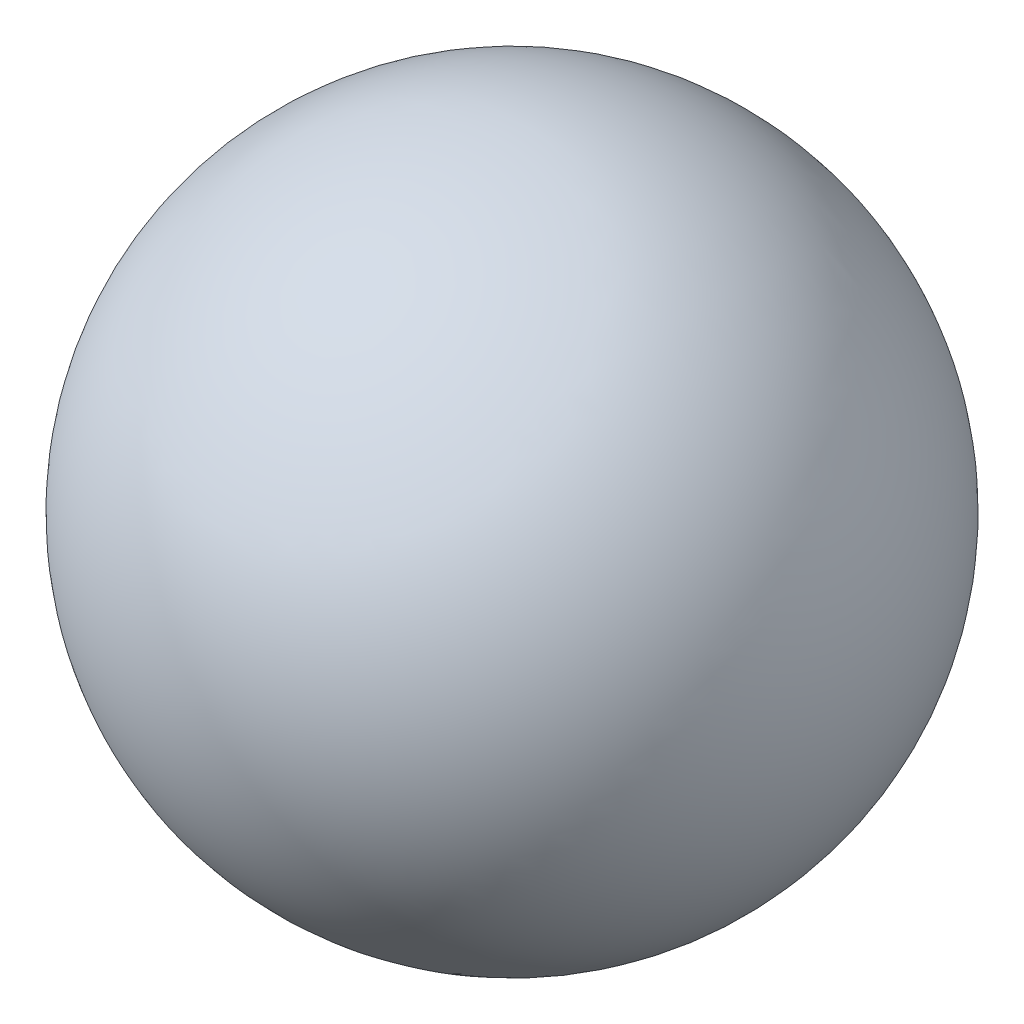
ISO-10303-21;
HEADER;
FILE_DESCRIPTION(('STEP AP214'),'2;1');
FILE_NAME('part.step','',(''),(''),'','','');
FILE_SCHEMA(('AUTOMOTIVE_DESIGN { 1 0 10303 214 1 1 1 1 }'));
ENDSEC;
DATA;
#1=APPLICATION_CONTEXT('core data for automotive mechanical design processes');
#2=APPLICATION_PROTOCOL_DEFINITION('international standard','automotive_design',2000,#1);
#3=PRODUCT_CONTEXT('',#1,'mechanical');
#4=PRODUCT('Part','Part','',(#3));
#5=PRODUCT_RELATED_PRODUCT_CATEGORY('part','',(#4));
#6=PRODUCT_DEFINITION_FORMATION('','',#4);
#7=PRODUCT_DEFINITION_CONTEXT('part definition',#1,'design');
#8=PRODUCT_DEFINITION('design','',#6,#7);
#9=PRODUCT_DEFINITION_SHAPE('','',#8);
#10=(LENGTH_UNIT() NAMED_UNIT(*) SI_UNIT(.MILLI.,.METRE.));
#11=(NAMED_UNIT(*) PLANE_ANGLE_UNIT() SI_UNIT($,.RADIAN.));
#12=(NAMED_UNIT(*) SI_UNIT($,.STERADIAN.) SOLID_ANGLE_UNIT());
#13=UNCERTAINTY_MEASURE_WITH_UNIT(LENGTH_MEASURE(1.E-05),#10,'distance_accuracy_value','');
#14=(GEOMETRIC_REPRESENTATION_CONTEXT(3) GLOBAL_UNCERTAINTY_ASSIGNED_CONTEXT((#13)) GLOBAL_UNIT_ASSIGNED_CONTEXT((#10,
#11,#12)) REPRESENTATION_CONTEXT('',''));
#15=CARTESIAN_POINT('',(0.,0.,0.));
#16=DIRECTION('',(0.,0.,1.));
#17=DIRECTION('',(1.,0.,0.));
#18=AXIS2_PLACEMENT_3D('',#15,#16,#17);
#19=CARTESIAN_POINT('',(0.,0.,0.));
#20=DIRECTION('',(0.,0.,-1.));
#21=DIRECTION('',(-1.,0.,0.));
#22=AXIS2_PLACEMENT_3D('',#19,#20,#21);
#23=SPHERICAL_SURFACE('',#22,20.);
#24=CARTESIAN_POINT('',(-6.5,0.,0.));
#25=DIRECTION('',(1.,0.,0.));
#26=DIRECTION('',(0.,0.,-1.));
#27=AXIS2_PLACEMENT_3D('',#24,#25,#26);
#28=CIRCLE('',#27,18.9142803193777);
#29=CARTESIAN_POINT('',(-6.5,-16.8967452487158,8.5));
#30=VERTEX_POINT('',#29);
#31=CARTESIAN_POINT('',(-6.5,-16.8967452487158,-8.5));
#32=VERTEX_POINT('',#31);
#33=EDGE_CURVE('E136',#30,#32,#28,.T.);
#34=ORIENTED_EDGE('',*,*,#33,.F.);
#35=CARTESIAN_POINT('',(-2.5,-15.4110350074224,12.5));
#36=CARTESIAN_POINT('',(-2.59738038519083,-15.3952282696164,12.5000148213943));
#37=CARTESIAN_POINT('',(-2.69508024486914,-15.3813255532214,12.4964443244474));
#38=CARTESIAN_POINT('',(-2.89044586607563,-15.3574814182854,12.4820993500437));
#39=CARTESIAN_POINT('',(-2.98811162156256,-15.3475405121033,12.4713239412978));
#40=CARTESIAN_POINT('',(-3.18255066929817,-15.3317903628193,12.4425594165742));
#41=CARTESIAN_POINT('',(-3.27932516375751,-15.325974361548,12.4245821759372));
#42=CARTESIAN_POINT('',(-3.47142933766073,-15.318532360721,12.3814961401043));
#43=CARTESIAN_POINT('',(-3.56675913489966,-15.3169060177094,12.3563879296716));
#44=CARTESIAN_POINT('',(-3.75539293433253,-15.3178685885579,12.2991727800464));
#45=CARTESIAN_POINT('',(-3.84869448864158,-15.3204623373541,12.2670578498045));
#46=CARTESIAN_POINT('',(-4.03251988927804,-15.3298356353688,12.1960918680488));
#47=CARTESIAN_POINT('',(-4.12304268359437,-15.3366167498573,12.1572383014875));
#48=CARTESIAN_POINT('',(-4.30060029606627,-15.3542614783381,12.07316063338));
#49=CARTESIAN_POINT('',(-4.38763726831352,-15.3651225266426,12.0279405466037));
#50=CARTESIAN_POINT('',(-4.55773919754725,-15.3907677735966,11.9315137822873));
#51=CARTESIAN_POINT('',(-4.64080262813068,-15.4055534658075,11.8803048297852));
#52=CARTESIAN_POINT('',(-4.88337806728256,-15.45553866524,11.718267896581));
#53=CARTESIAN_POINT('',(-5.03626357260689,-15.4963651054398,11.5990354006361));
#54=CARTESIAN_POINT('',(-5.32106637967054,-15.5909729245315,11.342262090132));
#55=CARTESIAN_POINT('',(-5.45297406407673,-15.6447602170995,11.204712931043));
#56=CARTESIAN_POINT('',(-5.70421893362637,-15.7680434301898,10.9030476449279));
#57=CARTESIAN_POINT('',(-5.82158158675651,-15.8384770121789,10.7376716659214));
#58=CARTESIAN_POINT('',(-6.0285963358221,-15.9892385784958,10.3945266003605));
#59=CARTESIAN_POINT('',(-6.1182285174705,-16.0695736158011,10.216748719296));
#60=CARTESIAN_POINT('',(-6.27889155103766,-16.2481674906663,9.83009006167));
#61=CARTESIAN_POINT('',(-6.34617113011318,-16.3474101903572,9.62010759001408));
#62=CARTESIAN_POINT('',(-6.44516668446247,-16.5519643767159,9.1951210889375));
#63=CARTESIAN_POINT('',(-6.47692305807516,-16.6572688260762,8.9801230481741));
#64=CARTESIAN_POINT('',(-6.49708269575086,-16.8081535716689,8.67662013097272));
#65=CARTESIAN_POINT('',(-6.50000578257493,-16.8523596129254,8.5882364623455));
#66=CARTESIAN_POINT('',(-6.50000000000009,-16.8967452487158,8.49999999999999));
#67=B_SPLINE_CURVE_WITH_KNOTS('',3,(#35,#36,#37,#38,#39,#40,#41,#42,#43,#44,#45,#46,#47,#48,#49,
#50,#51,#52,#53,#54,#55,#56,#57,#58,#59,#60,#61,#62,#63,#64,#65,#66),.UNSPECIFIED.,.F.,.F.,(4,2,
2,2,2,2,2,2,2,2,2,2,2,2,2,4),(0.,0.295896456010633,0.591831166267823,0.887279895354373,
1.18270440365701,1.47846761661165,1.77434145515047,2.07002954249381,2.36583031854621,
2.9574702952876,3.54938073373924,4.19080463658617,4.83268810636278,5.55520721793995,
6.27690381531875,6.57330293254065),.UNSPECIFIED.);
#68=CARTESIAN_POINT('',(-2.5,-15.4110350074224,12.5));
#69=VERTEX_POINT('',#68);
#70=EDGE_CURVE('E11',#69,#30,#67,.T.);
#71=ORIENTED_EDGE('',*,*,#70,.F.);
#72=CARTESIAN_POINT('',(0.,0.,12.5));
#73=DIRECTION('',(0.,0.,-1.));
#74=DIRECTION('',(-1.,0.,0.));
#75=AXIS2_PLACEMENT_3D('',#72,#73,#74);
#76=CIRCLE('',#75,15.612494995996);
#77=CARTESIAN_POINT('',(2.5,-15.4110350074224,12.5));
#78=VERTEX_POINT('',#77);
#79=EDGE_CURVE('E134',#78,#69,#76,.T.);
#80=ORIENTED_EDGE('',*,*,#79,.F.);
#81=CARTESIAN_POINT('',(6.5,-16.8967452487158,8.5));
#82=CARTESIAN_POINT('',(6.49999376318244,-16.8367881342585,8.61919141730628));
#83=CARTESIAN_POINT('',(6.49467104533204,-16.7772219118733,8.73852686841631));
#84=CARTESIAN_POINT('',(6.47327854145581,-16.6592450993487,8.97686071788792));
#85=CARTESIAN_POINT('',(6.45720456710805,-16.6008349687168,9.09585896673711));
#86=CARTESIAN_POINT('',(6.3925007431121,-16.4274610357574,9.45231560061206));
#87=CARTESIAN_POINT('',(6.32738664378277,-16.314890403822,9.68817108218945));
#88=CARTESIAN_POINT('',(6.15262165026794,-16.1001752719661,10.1489887531046));
#89=CARTESIAN_POINT('',(6.04284925214079,-15.998060175278,10.373919334601));
#90=CARTESIAN_POINT('',(5.84561038890766,-15.8568845783667,10.6960824044829));
#91=CARTESIAN_POINT('',(5.77445963035965,-15.8118369791686,10.8009028563226));
#92=CARTESIAN_POINT('',(5.62151864141891,-15.7263629975264,11.004454776878));
#93=CARTESIAN_POINT('',(5.53973510966124,-15.6859337354104,11.1031900220199));
#94=CARTESIAN_POINT('',(5.37423953151036,-15.6139957920711,11.28430049176));
#95=CARTESIAN_POINT('',(5.29145989423178,-15.5820037606912,11.3673372721214));
#96=CARTESIAN_POINT('',(5.11800479405772,-15.5228802142727,11.5265317286208));
#97=CARTESIAN_POINT('',(5.02733403862039,-15.495745830536,11.6026934515803));
#98=CARTESIAN_POINT('',(4.83870098175006,-15.4468103505463,11.7472438065387));
#99=CARTESIAN_POINT('',(4.74074148755169,-15.4250072147064,11.8156354057927));
#100=CARTESIAN_POINT('',(4.53829135479281,-15.3871509666637,11.9437934115337));
#101=CARTESIAN_POINT('',(4.43380185354477,-15.3710968564296,12.0035613140184));
#102=CARTESIAN_POINT('',(4.23365775172472,-15.3468202002661,12.106291007457));
#103=CARTESIAN_POINT('',(4.13869811103613,-15.3378360100475,12.150431731578));
#104=CARTESIAN_POINT('',(3.94532985325401,-15.3245772396421,12.2312192704823));
#105=CARTESIAN_POINT('',(3.84692162959918,-15.320302124004,12.2678669368872));
#106=CARTESIAN_POINT('',(3.64751450761934,-15.3165360276597,12.3333032600585));
#107=CARTESIAN_POINT('',(3.54651748819676,-15.3170416700219,12.3620974494102));
#108=CARTESIAN_POINT('',(3.3427374099056,-15.3228177568241,12.4116221190603));
#109=CARTESIAN_POINT('',(3.23995498732285,-15.3280865366015,12.4323554129305));
#110=CARTESIAN_POINT('',(3.03088558050845,-15.3434876216961,12.4660602696253));
#111=CARTESIAN_POINT('',(2.92457449976527,-15.3537361309077,12.4788288243646));
#112=CARTESIAN_POINT('',(2.71204841485452,-15.3789236562842,12.4958003911938));
#113=CARTESIAN_POINT('',(2.60583367151853,-15.3938528619271,12.5000211822262));
#114=CARTESIAN_POINT('',(2.5,-15.4110350074224,12.5));
#115=B_SPLINE_CURVE_WITH_KNOTS('',3,(#81,#82,#83,#84,#85,#86,#87,#88,#89,#90,#91,#92,#93,#94,
#95,#96,#97,#98,#99,#100,#101,#102,#103,#104,#105,#106,#107,#108,#109,#110,#111,#112,#113,#114),
.UNSPECIFIED.,.F.,.F.,(4,2,2,2,2,2,2,2,2,2,2,2,2,2,2,2,4),(0.,0.400059142691313,
0.800274225587917,1.60423831208424,2.41040456820755,2.8132520749623,3.21584700703939,
3.57994025204138,3.94381776627734,4.30755585254038,4.67123076319907,4.98612350570043,
5.30098043922891,5.61561498734561,5.93013961674454,6.25238444943157,6.57395833692662),.UNSPECIFIED.);
#116=CARTESIAN_POINT('',(6.5,-16.8967452487158,8.5));
#117=VERTEX_POINT('',#116);
#118=EDGE_CURVE('E51',#117,#78,#115,.T.);
#119=ORIENTED_EDGE('',*,*,#118,.F.);
#120=CARTESIAN_POINT('',(6.5,0.,0.));
#121=DIRECTION('',(-1.,0.,0.));
#122=DIRECTION('',(0.,0.,1.));
#123=AXIS2_PLACEMENT_3D('',#120,#121,#122);
#124=CIRCLE('',#123,18.9142803193777);
#125=CARTESIAN_POINT('',(6.5,-16.8967452487158,-8.5));
#126=VERTEX_POINT('',#125);
#127=EDGE_CURVE('E146',#126,#117,#124,.T.);
#128=ORIENTED_EDGE('',*,*,#127,.F.);
#129=CARTESIAN_POINT('',(2.5,-15.4110350074224,-12.5));
#130=CARTESIAN_POINT('',(2.59738038519083,-15.3952282696164,-12.5000148213943));
#131=CARTESIAN_POINT('',(2.69508024486914,-15.3813255532214,-12.4964443244474));
#132=CARTESIAN_POINT('',(2.89044586607563,-15.3574814182854,-12.4820993500437));
#133=CARTESIAN_POINT('',(2.98811162156256,-15.3475405121033,-12.4713239412978));
#134=CARTESIAN_POINT('',(3.18255066929817,-15.3317903628193,-12.4425594165742));
#135=CARTESIAN_POINT('',(3.27932516375751,-15.325974361548,-12.4245821759372));
#136=CARTESIAN_POINT('',(3.47142933766073,-15.318532360721,-12.3814961401043));
#137=CARTESIAN_POINT('',(3.56675913489966,-15.3169060177094,-12.3563879296716));
#138=CARTESIAN_POINT('',(3.75539293433253,-15.3178685885579,-12.2991727800464));
#139=CARTESIAN_POINT('',(3.84869448864158,-15.3204623373541,-12.2670578498045));
#140=CARTESIAN_POINT('',(4.03251988927804,-15.3298356353688,-12.1960918680488));
#141=CARTESIAN_POINT('',(4.12304268359437,-15.3366167498573,-12.1572383014875));
#142=CARTESIAN_POINT('',(4.30060029606627,-15.3542614783381,-12.07316063338));
#143=CARTESIAN_POINT('',(4.38763726831352,-15.3651225266426,-12.0279405466037));
#144=CARTESIAN_POINT('',(4.55773919754725,-15.3907677735966,-11.9315137822873));
#145=CARTESIAN_POINT('',(4.64080262813068,-15.4055534658075,-11.8803048297852));
#146=CARTESIAN_POINT('',(4.88337806728256,-15.45553866524,-11.718267896581));
#147=CARTESIAN_POINT('',(5.03626357260689,-15.4963651054398,-11.5990354006361));
#148=CARTESIAN_POINT('',(5.32106637967054,-15.5909729245315,-11.342262090132));
#149=CARTESIAN_POINT('',(5.45297406407673,-15.6447602170995,-11.204712931043));
#150=CARTESIAN_POINT('',(5.70421893362637,-15.7680434301898,-10.9030476449279));
#151=CARTESIAN_POINT('',(5.82158158675651,-15.8384770121789,-10.7376716659214));
#152=CARTESIAN_POINT('',(6.0285963358221,-15.9892385784958,-10.3945266003605));
#153=CARTESIAN_POINT('',(6.1182285174705,-16.0695736158011,-10.216748719296));
#154=CARTESIAN_POINT('',(6.27889155103766,-16.2481674906663,-9.83009006167));
#155=CARTESIAN_POINT('',(6.34617113011318,-16.3474101903572,-9.62010759001408));
#156=CARTESIAN_POINT('',(6.44516668446247,-16.5519643767159,-9.1951210889375));
#157=CARTESIAN_POINT('',(6.47692305807516,-16.6572688260762,-8.9801230481741));
#158=CARTESIAN_POINT('',(6.49708269575086,-16.8081535716689,-8.67662013097272));
#159=CARTESIAN_POINT('',(6.50000578257493,-16.8523596129254,-8.5882364623455));
#160=CARTESIAN_POINT('',(6.50000000000009,-16.8967452487158,-8.49999999999999));
#161=B_SPLINE_CURVE_WITH_KNOTS('',3,(#129,#130,#131,#132,#133,#134,#135,#136,#137,#138,#139,
#140,#141,#142,#143,#144,#145,#146,#147,#148,#149,#150,#151,#152,#153,#154,#155,#156,#157,#158,
#159,#160),.UNSPECIFIED.,.F.,.F.,(4,2,2,2,2,2,2,2,2,2,2,2,2,2,2,4),(0.,0.295896456010633,
0.591831166267823,0.887279895354373,1.18270440365701,1.47846761661165,1.77434145515047,
2.07002954249381,2.36583031854621,2.9574702952876,3.54938073373924,4.19080463658617,
4.83268810636278,5.55520721793995,6.27690381531875,6.57330293254065),.UNSPECIFIED.);
#162=CARTESIAN_POINT('',(2.5,-15.4110350074224,-12.5));
#163=VERTEX_POINT('',#162);
#164=EDGE_CURVE('E171',#163,#126,#161,.T.);
#165=ORIENTED_EDGE('',*,*,#164,.F.);
#166=CARTESIAN_POINT('',(0.,0.,-12.5));
#167=DIRECTION('',(0.,0.,1.));
#168=DIRECTION('',(1.,0.,0.));
#169=AXIS2_PLACEMENT_3D('',#166,#167,#168);
#170=CIRCLE('',#169,15.612494995996);
#171=CARTESIAN_POINT('',(-2.5,-15.4110350074224,-12.5));
#172=VERTEX_POINT('',#171);
#173=EDGE_CURVE('E144',#172,#163,#170,.T.);
#174=ORIENTED_EDGE('',*,*,#173,.F.);
#175=CARTESIAN_POINT('',(-6.5,-16.8967452487158,-8.5));
#176=CARTESIAN_POINT('',(-6.49999376318244,-16.8367881342585,-8.61919141730628));
#177=CARTESIAN_POINT('',(-6.49467104533204,-16.7772219118733,-8.73852686841631));
#178=CARTESIAN_POINT('',(-6.47327854145581,-16.6592450993487,-8.97686071788792));
#179=CARTESIAN_POINT('',(-6.45720456710805,-16.6008349687168,-9.09585896673711));
#180=CARTESIAN_POINT('',(-6.3925007431121,-16.4274610357574,-9.45231560061206));
#181=CARTESIAN_POINT('',(-6.32738664378277,-16.314890403822,-9.68817108218945));
#182=CARTESIAN_POINT('',(-6.15262165026794,-16.1001752719661,-10.1489887531046));
#183=CARTESIAN_POINT('',(-6.04284925214079,-15.998060175278,-10.373919334601));
#184=CARTESIAN_POINT('',(-5.84561038890766,-15.8568845783667,-10.6960824044829));
#185=CARTESIAN_POINT('',(-5.77445963035965,-15.8118369791686,-10.8009028563226));
#186=CARTESIAN_POINT('',(-5.62151864141891,-15.7263629975264,-11.004454776878));
#187=CARTESIAN_POINT('',(-5.53973510966124,-15.6859337354104,-11.1031900220199));
#188=CARTESIAN_POINT('',(-5.37423953151036,-15.6139957920711,-11.28430049176));
#189=CARTESIAN_POINT('',(-5.29145989423178,-15.5820037606912,-11.3673372721214));
#190=CARTESIAN_POINT('',(-5.11800479405772,-15.5228802142727,-11.5265317286208));
#191=CARTESIAN_POINT('',(-5.02733403862039,-15.495745830536,-11.6026934515803));
#192=CARTESIAN_POINT('',(-4.83870098175006,-15.4468103505463,-11.7472438065387));
#193=CARTESIAN_POINT('',(-4.74074148755169,-15.4250072147064,-11.8156354057927));
#194=CARTESIAN_POINT('',(-4.53829135479281,-15.3871509666637,-11.9437934115337));
#195=CARTESIAN_POINT('',(-4.43380185354477,-15.3710968564296,-12.0035613140184));
#196=CARTESIAN_POINT('',(-4.23365775172472,-15.3468202002661,-12.106291007457));
#197=CARTESIAN_POINT('',(-4.13869811103613,-15.3378360100475,-12.150431731578));
#198=CARTESIAN_POINT('',(-3.94532985325401,-15.3245772396421,-12.2312192704823));
#199=CARTESIAN_POINT('',(-3.84692162959918,-15.320302124004,-12.2678669368872));
#200=CARTESIAN_POINT('',(-3.64751450761934,-15.3165360276597,-12.3333032600585));
#201=CARTESIAN_POINT('',(-3.54651748819676,-15.3170416700219,-12.3620974494102));
#202=CARTESIAN_POINT('',(-3.3427374099056,-15.3228177568241,-12.4116221190603));
#203=CARTESIAN_POINT('',(-3.23995498732285,-15.3280865366015,-12.4323554129305));
#204=CARTESIAN_POINT('',(-3.03088558050845,-15.3434876216961,-12.4660602696253));
#205=CARTESIAN_POINT('',(-2.92457449976527,-15.3537361309077,-12.4788288243646));
#206=CARTESIAN_POINT('',(-2.71204841485452,-15.3789236562842,-12.4958003911938));
#207=CARTESIAN_POINT('',(-2.60583367151853,-15.3938528619271,-12.5000211822262));
#208=CARTESIAN_POINT('',(-2.5,-15.4110350074224,-12.5));
#209=B_SPLINE_CURVE_WITH_KNOTS('',3,(#175,#176,#177,#178,#179,#180,#181,#182,#183,#184,#185,
#186,#187,#188,#189,#190,#191,#192,#193,#194,#195,#196,#197,#198,#199,#200,#201,#202,#203,#204,
#205,#206,#207,#208),.UNSPECIFIED.,.F.,.F.,(4,2,2,2,2,2,2,2,2,2,2,2,2,2,2,2,4),(0.,
0.400059142691313,0.800274225587917,1.60423831208424,2.41040456820755,2.8132520749623,
3.21584700703939,3.57994025204138,3.94381776627734,4.30755585254038,4.67123076319907,
4.98612350570043,5.30098043922891,5.61561498734561,5.93013961674454,6.25238444943157,
6.57395833692662),.UNSPECIFIED.);
#210=EDGE_CURVE('E126',#32,#172,#209,.T.);
#211=ORIENTED_EDGE('',*,*,#210,.F.);
#212=EDGE_LOOP('',(#34,#71,#80,#119,#128,#165,#174,#211));
#213=FACE_BOUND('',#212,.T.);
#214=ADVANCED_FACE('F37',(#213),#23,.T.);
#215=CARTESIAN_POINT('',(6.5,-27.,-12.5));
#216=DIRECTION('',(1.,0.,0.));
#217=DIRECTION('',(0.,0.,1.));
#218=AXIS2_PLACEMENT_3D('',#215,#216,#217);
#219=PLANE('',#218);
#220=ORIENTED_EDGE('',*,*,#127,.T.);
#221=DIRECTION('',(0.,1.,0.));
#222=VECTOR('',#221,1.);
#223=CARTESIAN_POINT('',(6.5,-14.1950695665784,8.5));
#224=LINE('',#223,#222);
#225=CARTESIAN_POINT('',(6.5,0.,8.5));
#226=VERTEX_POINT('',#225);
#227=EDGE_CURVE('E158',#226,#117,#224,.F.);
#228=ORIENTED_EDGE('',*,*,#227,.F.);
#229=DIRECTION('',(0.,0.,1.));
#230=VECTOR('',#229,1.);
#231=CARTESIAN_POINT('',(6.5,0.,-12.5));
#232=LINE('',#231,#230);
#233=CARTESIAN_POINT('',(6.5,0.,-8.5));
#234=VERTEX_POINT('',#233);
#235=EDGE_CURVE('E212',#234,#226,#232,.T.);
#236=ORIENTED_EDGE('',*,*,#235,.F.);
#237=DIRECTION('',(0.,1.,0.));
#238=VECTOR('',#237,1.);
#239=CARTESIAN_POINT('',(6.5,0.,-8.5));
#240=LINE('',#239,#238);
#241=EDGE_CURVE('E160',#126,#234,#240,.T.);
#242=ORIENTED_EDGE('',*,*,#241,.F.);
#243=EDGE_LOOP('',(#220,#228,#236,#242));
#244=FACE_BOUND('',#243,.T.);
#245=ADVANCED_FACE('F181',(#244),#219,.F.);
#246=CARTESIAN_POINT('',(-6.5,-27.,-12.5));
#247=DIRECTION('',(0.,0.,-1.));
#248=DIRECTION('',(1.,0.,0.));
#249=AXIS2_PLACEMENT_3D('',#246,#247,#248);
#250=PLANE('',#249);
#251=ORIENTED_EDGE('',*,*,#173,.T.);
#252=DIRECTION('',(0.,1.,0.));
#253=VECTOR('',#252,1.);
#254=CARTESIAN_POINT('',(2.5,-14.1950695665784,-12.5));
#255=LINE('',#254,#253);
#256=CARTESIAN_POINT('',(2.5,0.,-12.5));
#257=VERTEX_POINT('',#256);
#258=EDGE_CURVE('E131',#257,#163,#255,.F.);
#259=ORIENTED_EDGE('',*,*,#258,.F.);
#260=DIRECTION('',(1.,0.,0.));
#261=VECTOR('',#260,1.);
#262=CARTESIAN_POINT('',(-6.5,0.,-12.5));
#263=LINE('',#262,#261);
#264=CARTESIAN_POINT('',(-2.5,0.,-12.5));
#265=VERTEX_POINT('',#264);
#266=EDGE_CURVE('E113',#265,#257,#263,.T.);
#267=ORIENTED_EDGE('',*,*,#266,.F.);
#268=DIRECTION('',(0.,1.,0.));
#269=VECTOR('',#268,1.);
#270=CARTESIAN_POINT('',(-2.5,0.,-12.5));
#271=LINE('',#270,#269);
#272=EDGE_CURVE('E123',#172,#265,#271,.T.);
#273=ORIENTED_EDGE('',*,*,#272,.F.);
#274=EDGE_LOOP('',(#251,#259,#267,#273));
#275=FACE_BOUND('',#274,.T.);
#276=ADVANCED_FACE('F133',(#275),#250,.F.);
#277=CARTESIAN_POINT('',(-6.5,-27.,-12.5));
#278=DIRECTION('',(-1.,0.,0.));
#279=DIRECTION('',(0.,0.,-1.));
#280=AXIS2_PLACEMENT_3D('',#277,#278,#279);
#281=PLANE('',#280);
#282=DIRECTION('',(0.,0.,-1.));
#283=VECTOR('',#282,1.);
#284=CARTESIAN_POINT('',(-6.5,0.,-12.5));
#285=LINE('',#284,#283);
#286=CARTESIAN_POINT('',(-6.5,0.,8.5));
#287=VERTEX_POINT('',#286);
#288=CARTESIAN_POINT('',(-6.5,0.,-8.5));
#289=VERTEX_POINT('',#288);
#290=EDGE_CURVE('E116',#287,#289,#285,.T.);
#291=ORIENTED_EDGE('',*,*,#290,.F.);
#292=DIRECTION('',(0.,1.,0.));
#293=VECTOR('',#292,1.);
#294=CARTESIAN_POINT('',(-6.5,0.,8.5));
#295=LINE('',#294,#293);
#296=EDGE_CURVE('E119',#30,#287,#295,.T.);
#297=ORIENTED_EDGE('',*,*,#296,.F.);
#298=ORIENTED_EDGE('',*,*,#33,.T.);
#299=DIRECTION('',(0.,1.,0.));
#300=VECTOR('',#299,1.);
#301=CARTESIAN_POINT('',(-6.5,-14.1950695665784,-8.5));
#302=LINE('',#301,#300);
#303=EDGE_CURVE('E156',#289,#32,#302,.F.);
#304=ORIENTED_EDGE('',*,*,#303,.F.);
#305=EDGE_LOOP('',(#291,#297,#298,#304));
#306=FACE_BOUND('',#305,.T.);
#307=ADVANCED_FACE('F218',(#306),#281,.F.);
#308=CARTESIAN_POINT('',(-6.5,-27.,12.5));
#309=DIRECTION('',(0.,0.,1.));
#310=DIRECTION('',(-1.,0.,0.));
#311=AXIS2_PLACEMENT_3D('',#308,#309,#310);
#312=PLANE('',#311);
#313=ORIENTED_EDGE('',*,*,#79,.T.);
#314=DIRECTION('',(0.,1.,0.));
#315=VECTOR('',#314,1.);
#316=CARTESIAN_POINT('',(-2.5,-14.1950695665784,12.5));
#317=LINE('',#316,#315);
#318=CARTESIAN_POINT('',(-2.5,0.,12.5));
#319=VERTEX_POINT('',#318);
#320=EDGE_CURVE('E57',#319,#69,#317,.F.);
#321=ORIENTED_EDGE('',*,*,#320,.F.);
#322=DIRECTION('',(-1.,0.,0.));
#323=VECTOR('',#322,1.);
#324=CARTESIAN_POINT('',(-6.5,0.,12.5));
#325=LINE('',#324,#323);
#326=CARTESIAN_POINT('',(2.5,0.,12.5));
#327=VERTEX_POINT('',#326);
#328=EDGE_CURVE('E138',#327,#319,#325,.T.);
#329=ORIENTED_EDGE('',*,*,#328,.F.);
#330=DIRECTION('',(0.,1.,0.));
#331=VECTOR('',#330,1.);
#332=CARTESIAN_POINT('',(2.5,0.,12.5));
#333=LINE('',#332,#331);
#334=EDGE_CURVE('E64',#78,#327,#333,.T.);
#335=ORIENTED_EDGE('',*,*,#334,.F.);
#336=EDGE_LOOP('',(#313,#321,#329,#335));
#337=FACE_BOUND('',#336,.T.);
#338=ADVANCED_FACE('F215',(#337),#312,.F.);
#339=CARTESIAN_POINT('',(0.,0.,0.));
#340=DIRECTION('',(0.,-1.,0.));
#341=DIRECTION('',(0.,0.,1.));
#342=AXIS2_PLACEMENT_3D('',#339,#340,#341);
#343=PLANE('',#342);
#344=ORIENTED_EDGE('',*,*,#266,.T.);
#345=CARTESIAN_POINT('',(2.5,0.,-8.5));
#346=DIRECTION('',(0.,1.,0.));
#347=DIRECTION('',(0.,0.,1.));
#348=AXIS2_PLACEMENT_3D('',#345,#346,#347);
#349=CIRCLE('',#348,4.);
#350=EDGE_CURVE('E120',#234,#257,#349,.T.);
#351=ORIENTED_EDGE('',*,*,#350,.F.);
#352=ORIENTED_EDGE('',*,*,#235,.T.);
#353=CARTESIAN_POINT('',(2.5,0.,8.5));
#354=DIRECTION('',(0.,1.,0.));
#355=DIRECTION('',(0.,0.,1.));
#356=AXIS2_PLACEMENT_3D('',#353,#354,#355);
#357=CIRCLE('',#356,4.);
#358=EDGE_CURVE('E151',#327,#226,#357,.T.);
#359=ORIENTED_EDGE('',*,*,#358,.F.);
#360=ORIENTED_EDGE('',*,*,#328,.T.);
#361=CARTESIAN_POINT('',(-2.5,0.,8.5));
#362=DIRECTION('',(0.,1.,0.));
#363=DIRECTION('',(0.,0.,1.));
#364=AXIS2_PLACEMENT_3D('',#361,#362,#363);
#365=CIRCLE('',#364,4.);
#366=EDGE_CURVE('E130',#287,#319,#365,.T.);
#367=ORIENTED_EDGE('',*,*,#366,.F.);
#368=ORIENTED_EDGE('',*,*,#290,.T.);
#369=CARTESIAN_POINT('',(-2.5,0.,-8.5));
#370=DIRECTION('',(0.,1.,0.));
#371=DIRECTION('',(0.,0.,1.));
#372=AXIS2_PLACEMENT_3D('',#369,#370,#371);
#373=CIRCLE('',#372,4.);
#374=EDGE_CURVE('E109',#265,#289,#373,.T.);
#375=ORIENTED_EDGE('',*,*,#374,.F.);
#376=EDGE_LOOP('',(#344,#351,#352,#359,#360,#367,#368,#375));
#377=FACE_BOUND('',#376,.T.);
#378=ADVANCED_FACE('F111',(#377),#343,.T.);
#379=CARTESIAN_POINT('',(-2.5,-27.,-8.5));
#380=DIRECTION('',(0.,-1.,0.));
#381=DIRECTION('',(0.,0.,1.));
#382=AXIS2_PLACEMENT_3D('',#379,#380,#381);
#383=CYLINDRICAL_SURFACE('',#382,4.);
#384=ORIENTED_EDGE('',*,*,#210,.T.);
#385=ORIENTED_EDGE('',*,*,#272,.T.);
#386=ORIENTED_EDGE('',*,*,#374,.T.);
#387=ORIENTED_EDGE('',*,*,#303,.T.);
#388=EDGE_LOOP('',(#384,#385,#386,#387));
#389=FACE_BOUND('',#388,.T.);
#390=ADVANCED_FACE('F124',(#389),#383,.F.);
#391=CARTESIAN_POINT('',(2.5,-27.,-8.5));
#392=DIRECTION('',(0.,-1.,0.));
#393=DIRECTION('',(0.,0.,1.));
#394=AXIS2_PLACEMENT_3D('',#391,#392,#393);
#395=CYLINDRICAL_SURFACE('',#394,4.);
#396=ORIENTED_EDGE('',*,*,#164,.T.);
#397=ORIENTED_EDGE('',*,*,#241,.T.);
#398=ORIENTED_EDGE('',*,*,#350,.T.);
#399=ORIENTED_EDGE('',*,*,#258,.T.);
#400=EDGE_LOOP('',(#396,#397,#398,#399));
#401=FACE_BOUND('',#400,.T.);
#402=ADVANCED_FACE('F194',(#401),#395,.F.);
#403=CARTESIAN_POINT('',(2.5,-27.,8.5));
#404=DIRECTION('',(0.,-1.,0.));
#405=DIRECTION('',(0.,0.,1.));
#406=AXIS2_PLACEMENT_3D('',#403,#404,#405);
#407=CYLINDRICAL_SURFACE('',#406,4.);
#408=ORIENTED_EDGE('',*,*,#118,.T.);
#409=ORIENTED_EDGE('',*,*,#334,.T.);
#410=ORIENTED_EDGE('',*,*,#358,.T.);
#411=ORIENTED_EDGE('',*,*,#227,.T.);
#412=EDGE_LOOP('',(#408,#409,#410,#411));
#413=FACE_BOUND('',#412,.T.);
#414=ADVANCED_FACE('F191',(#413),#407,.F.);
#415=CARTESIAN_POINT('',(-2.5,-27.,8.5));
#416=DIRECTION('',(0.,-1.,0.));
#417=DIRECTION('',(0.,0.,1.));
#418=AXIS2_PLACEMENT_3D('',#415,#416,#417);
#419=CYLINDRICAL_SURFACE('',#418,4.);
#420=ORIENTED_EDGE('',*,*,#70,.T.);
#421=ORIENTED_EDGE('',*,*,#296,.T.);
#422=ORIENTED_EDGE('',*,*,#366,.T.);
#423=ORIENTED_EDGE('',*,*,#320,.T.);
#424=EDGE_LOOP('',(#420,#421,#422,#423));
#425=FACE_BOUND('',#424,.T.);
#426=ADVANCED_FACE('F39',(#425),#419,.F.);
#427=CLOSED_SHELL('',(#214,#245,#276,#307,#338,#378,#390,#402,#414,#426));
#428=MANIFOLD_SOLID_BREP('B2',#427);
#429=ADVANCED_BREP_SHAPE_REPRESENTATION('',(#18,#428),#14);
#430=SHAPE_DEFINITION_REPRESENTATION(#9,#429);
ENDSEC;
END-ISO-10303-21;
